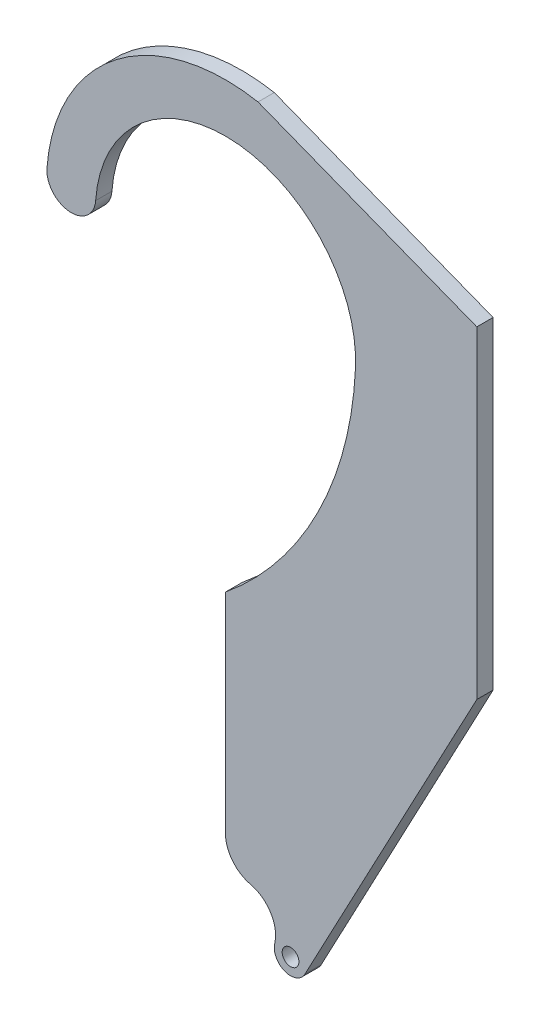
ISO-10303-21;
HEADER;
FILE_DESCRIPTION(('STEP AP214'),'2;1');
FILE_NAME('part.step','',(''),(''),'','','');
FILE_SCHEMA(('AUTOMOTIVE_DESIGN { 1 0 10303 214 1 1 1 1 }'));
ENDSEC;
DATA;
#1=APPLICATION_CONTEXT('core data for automotive mechanical design processes');
#2=APPLICATION_PROTOCOL_DEFINITION('international standard','automotive_design',2000,#1);
#3=PRODUCT_CONTEXT('',#1,'mechanical');
#4=PRODUCT('Part','Part','',(#3));
#5=PRODUCT_RELATED_PRODUCT_CATEGORY('part','',(#4));
#6=PRODUCT_DEFINITION_FORMATION('','',#4);
#7=PRODUCT_DEFINITION_CONTEXT('part definition',#1,'design');
#8=PRODUCT_DEFINITION('design','',#6,#7);
#9=PRODUCT_DEFINITION_SHAPE('','',#8);
#10=(LENGTH_UNIT() NAMED_UNIT(*) SI_UNIT(.MILLI.,.METRE.));
#11=(NAMED_UNIT(*) PLANE_ANGLE_UNIT() SI_UNIT($,.RADIAN.));
#12=(NAMED_UNIT(*) SI_UNIT($,.STERADIAN.) SOLID_ANGLE_UNIT());
#13=UNCERTAINTY_MEASURE_WITH_UNIT(LENGTH_MEASURE(1.E-05),#10,'distance_accuracy_value','');
#14=(GEOMETRIC_REPRESENTATION_CONTEXT(3) GLOBAL_UNCERTAINTY_ASSIGNED_CONTEXT((#13)) GLOBAL_UNIT_ASSIGNED_CONTEXT((#10,
#11,#12)) REPRESENTATION_CONTEXT('',''));
#15=CARTESIAN_POINT('',(0.,0.,0.));
#16=DIRECTION('',(0.,0.,1.));
#17=DIRECTION('',(1.,0.,0.));
#18=AXIS2_PLACEMENT_3D('',#15,#16,#17);
#19=CARTESIAN_POINT('',(-43.9714520688161,2.04932811099202,1.5875));
#20=DIRECTION('',(0.,0.,-1.));
#21=DIRECTION('',(-1.,0.,0.));
#22=AXIS2_PLACEMENT_3D('',#19,#20,#21);
#23=CYLINDRICAL_SURFACE('',#22,69.4191815319946);
#24=CARTESIAN_POINT('',(-43.9714520688161,2.04932811099202,-1.5875));
#25=DIRECTION('',(0.,0.,1.));
#26=DIRECTION('',(1.,0.,0.));
#27=AXIS2_PLACEMENT_3D('',#24,#25,#26);
#28=CIRCLE('',#27,69.4191815319946);
#29=CARTESIAN_POINT('',(0.,-51.667840164447,-1.5875));
#30=VERTEX_POINT('',#29);
#31=CARTESIAN_POINT('',(25.3724590889121,-1.18250572154241,-1.5875));
#32=VERTEX_POINT('',#31);
#33=EDGE_CURVE('E147',#30,#32,#28,.T.);
#34=ORIENTED_EDGE('',*,*,#33,.F.);
#35=DIRECTION('',(0.,0.,-1.));
#36=VECTOR('',#35,1.);
#37=CARTESIAN_POINT('',(0.,-51.667840164447,1.5875));
#38=LINE('',#37,#36);
#39=CARTESIAN_POINT('',(0.,-51.667840164447,1.5875));
#40=VERTEX_POINT('',#39);
#41=EDGE_CURVE('E11',#40,#30,#38,.T.);
#42=ORIENTED_EDGE('',*,*,#41,.F.);
#43=CARTESIAN_POINT('',(-43.9714520688161,2.04932811099202,1.5875));
#44=DIRECTION('',(0.,0.,1.));
#45=DIRECTION('',(1.,0.,0.));
#46=AXIS2_PLACEMENT_3D('',#43,#44,#45);
#47=CIRCLE('',#46,69.4191815319946);
#48=CARTESIAN_POINT('',(25.3724590889121,-1.18250572154241,1.5875));
#49=VERTEX_POINT('',#48);
#50=EDGE_CURVE('E175',#40,#49,#47,.T.);
#51=ORIENTED_EDGE('',*,*,#50,.T.);
#52=DIRECTION('',(0.,0.,-1.));
#53=VECTOR('',#52,1.);
#54=CARTESIAN_POINT('',(25.3724590889121,-1.18250572154241,1.5875));
#55=LINE('',#54,#53);
#56=EDGE_CURVE('E51',#49,#32,#55,.T.);
#57=ORIENTED_EDGE('',*,*,#56,.T.);
#58=EDGE_LOOP('',(#34,#42,#51,#57));
#59=FACE_BOUND('',#58,.T.);
#60=ADVANCED_FACE('F35',(#59),#23,.F.);
#61=CARTESIAN_POINT('',(0.,0.,1.5875));
#62=DIRECTION('',(-1.,0.,0.));
#63=DIRECTION('',(0.,0.,1.));
#64=AXIS2_PLACEMENT_3D('',#61,#62,#63);
#65=PLANE('',#64);
#66=DIRECTION('',(0.,1.,0.));
#67=VECTOR('',#66,1.);
#68=CARTESIAN_POINT('',(0.,0.,-1.5875));
#69=LINE('',#68,#67);
#70=CARTESIAN_POINT('',(0.,-92.4442334166062,-1.5875));
#71=VERTEX_POINT('',#70);
#72=EDGE_CURVE('E149',#71,#30,#69,.T.);
#73=ORIENTED_EDGE('',*,*,#72,.F.);
#74=DIRECTION('',(0.,0.,-1.));
#75=VECTOR('',#74,1.);
#76=CARTESIAN_POINT('',(0.,-92.4442334166062,1.5875));
#77=LINE('',#76,#75);
#78=CARTESIAN_POINT('',(0.,-92.4442334166062,1.5875));
#79=VERTEX_POINT('',#78);
#80=EDGE_CURVE('E43',#79,#71,#77,.T.);
#81=ORIENTED_EDGE('',*,*,#80,.F.);
#82=DIRECTION('',(0.,1.,0.));
#83=VECTOR('',#82,1.);
#84=CARTESIAN_POINT('',(0.,0.,1.5875));
#85=LINE('',#84,#83);
#86=EDGE_CURVE('E204',#79,#40,#85,.T.);
#87=ORIENTED_EDGE('',*,*,#86,.T.);
#88=ORIENTED_EDGE('',*,*,#41,.T.);
#89=EDGE_LOOP('',(#73,#81,#87,#88));
#90=FACE_BOUND('',#89,.T.);
#91=ADVANCED_FACE('F203',(#90),#65,.T.);
#92=CARTESIAN_POINT('',(6.35,-92.4442334166062,1.5875));
#93=DIRECTION('',(0.,0.,-1.));
#94=DIRECTION('',(-1.,0.,0.));
#95=AXIS2_PLACEMENT_3D('',#92,#93,#94);
#96=CYLINDRICAL_SURFACE('',#95,6.35);
#97=CARTESIAN_POINT('',(6.35,-92.4442334166062,-1.5875));
#98=DIRECTION('',(0.,0.,1.));
#99=DIRECTION('',(1.,0.,0.));
#100=AXIS2_PLACEMENT_3D('',#97,#98,#99);
#101=CIRCLE('',#100,6.35);
#102=CARTESIAN_POINT('',(4.89007732044275,-98.6241303226812,-1.5875));
#103=VERTEX_POINT('',#102);
#104=EDGE_CURVE('E153',#71,#103,#101,.T.);
#105=ORIENTED_EDGE('',*,*,#104,.T.);
#106=DIRECTION('',(0.,0.,-1.));
#107=VECTOR('',#106,1.);
#108=CARTESIAN_POINT('',(4.89007732044275,-98.6241303226812,1.5875));
#109=LINE('',#108,#107);
#110=CARTESIAN_POINT('',(4.89007732044275,-98.6241303226812,1.5875));
#111=VERTEX_POINT('',#110);
#112=EDGE_CURVE('E188',#111,#103,#109,.T.);
#113=ORIENTED_EDGE('',*,*,#112,.F.);
#114=CARTESIAN_POINT('',(6.35,-92.4442334166062,1.5875));
#115=DIRECTION('',(0.,0.,1.));
#116=DIRECTION('',(1.,0.,0.));
#117=AXIS2_PLACEMENT_3D('',#114,#115,#116);
#118=CIRCLE('',#117,6.35);
#119=EDGE_CURVE('E194',#79,#111,#118,.T.);
#120=ORIENTED_EDGE('',*,*,#119,.F.);
#121=ORIENTED_EDGE('',*,*,#80,.T.);
#122=EDGE_LOOP('',(#105,#113,#120,#121));
#123=FACE_BOUND('',#122,.T.);
#124=ADVANCED_FACE('F192',(#123),#96,.T.);
#125=CARTESIAN_POINT('',(3.43015464088551,-104.804027228756,1.5875));
#126=DIRECTION('',(0.,0.,-1.));
#127=DIRECTION('',(-1.,0.,0.));
#128=AXIS2_PLACEMENT_3D('',#125,#126,#127);
#129=CYLINDRICAL_SURFACE('',#128,6.35);
#130=CARTESIAN_POINT('',(3.43015464088551,-104.804027228756,-1.5875));
#131=DIRECTION('',(0.,0.,1.));
#132=DIRECTION('',(1.,0.,0.));
#133=AXIS2_PLACEMENT_3D('',#130,#131,#132);
#134=CIRCLE('',#133,6.35);
#135=CARTESIAN_POINT('',(9.61005154695762,-106.263949908313,-1.5875));
#136=VERTEX_POINT('',#135);
#137=EDGE_CURVE('E156',#136,#103,#134,.T.);
#138=ORIENTED_EDGE('',*,*,#137,.F.);
#139=DIRECTION('',(0.,0.,-1.));
#140=VECTOR('',#139,1.);
#141=CARTESIAN_POINT('',(9.61005154695762,-106.263949908313,1.5875));
#142=LINE('',#141,#140);
#143=CARTESIAN_POINT('',(9.61005154695762,-106.263949908313,1.5875));
#144=VERTEX_POINT('',#143);
#145=EDGE_CURVE('E186',#144,#136,#142,.T.);
#146=ORIENTED_EDGE('',*,*,#145,.F.);
#147=CARTESIAN_POINT('',(3.43015464088551,-104.804027228756,1.5875));
#148=DIRECTION('',(0.,0.,1.));
#149=DIRECTION('',(1.,0.,0.));
#150=AXIS2_PLACEMENT_3D('',#147,#148,#149);
#151=CIRCLE('',#150,6.35);
#152=EDGE_CURVE('E302',#144,#111,#151,.T.);
#153=ORIENTED_EDGE('',*,*,#152,.T.);
#154=ORIENTED_EDGE('',*,*,#112,.T.);
#155=EDGE_LOOP('',(#138,#146,#153,#154));
#156=FACE_BOUND('',#155,.T.);
#157=ADVANCED_FACE('F223',(#156),#129,.F.);
#158=CARTESIAN_POINT('',(12.6999999999979,-106.993911248092,1.5875));
#159=DIRECTION('',(0.,0.,-1.));
#160=DIRECTION('',(-1.,0.,0.));
#161=AXIS2_PLACEMENT_3D('',#158,#159,#160);
#162=CYLINDRICAL_SURFACE('',#161,3.17500000000289);
#163=CARTESIAN_POINT('',(12.6999999999979,-106.993911248092,-1.5875));
#164=DIRECTION('',(0.,0.,1.));
#165=DIRECTION('',(1.,0.,0.));
#166=AXIS2_PLACEMENT_3D('',#163,#164,#165);
#167=CIRCLE('',#166,3.17500000000289);
#168=CARTESIAN_POINT('',(15.5042733421712,-108.482761818964,-1.5875));
#169=VERTEX_POINT('',#168);
#170=EDGE_CURVE('E159',#136,#169,#167,.T.);
#171=ORIENTED_EDGE('',*,*,#170,.T.);
#172=DIRECTION('',(0.,0.,-1.));
#173=VECTOR('',#172,1.);
#174=CARTESIAN_POINT('',(15.5042733421712,-108.482761818964,1.5875));
#175=LINE('',#174,#173);
#176=CARTESIAN_POINT('',(15.5042733421712,-108.482761818964,1.5875));
#177=VERTEX_POINT('',#176);
#178=EDGE_CURVE('E183',#177,#169,#175,.T.);
#179=ORIENTED_EDGE('',*,*,#178,.F.);
#180=CARTESIAN_POINT('',(12.6999999999979,-106.993911248092,1.5875));
#181=DIRECTION('',(0.,0.,1.));
#182=DIRECTION('',(1.,0.,0.));
#183=AXIS2_PLACEMENT_3D('',#180,#181,#182);
#184=CIRCLE('',#183,3.17500000000289);
#185=EDGE_CURVE('E305',#144,#177,#184,.T.);
#186=ORIENTED_EDGE('',*,*,#185,.F.);
#187=ORIENTED_EDGE('',*,*,#145,.T.);
#188=EDGE_LOOP('',(#171,#179,#186,#187));
#189=FACE_BOUND('',#188,.T.);
#190=ADVANCED_FACE('F228',(#189),#162,.T.);
#191=CARTESIAN_POINT('',(57.0258255774436,-30.2762686106827,1.5875));
#192=DIRECTION('',(-0.883235698321893,0.468929313660211,0.));
#193=DIRECTION('',(-0.468929313660212,-0.883235698321894,0.));
#194=AXIS2_PLACEMENT_3D('',#191,#192,#193);
#195=PLANE('',#194);
#196=DIRECTION('',(0.468929313660212,0.883235698321894,0.));
#197=VECTOR('',#196,1.);
#198=CARTESIAN_POINT('',(57.0258255774436,-30.2762686106827,-1.5875));
#199=LINE('',#198,#197);
#200=CARTESIAN_POINT('',(49.0487017814658,-45.3013060764487,-1.5875));
#201=VERTEX_POINT('',#200);
#202=EDGE_CURVE('E161',#169,#201,#199,.T.);
#203=ORIENTED_EDGE('',*,*,#202,.T.);
#204=DIRECTION('',(0.,0.,-1.));
#205=VECTOR('',#204,1.);
#206=CARTESIAN_POINT('',(49.0487017814658,-45.3013060764487,1.5875));
#207=LINE('',#206,#205);
#208=CARTESIAN_POINT('',(49.0487017814658,-45.3013060764487,1.5875));
#209=VERTEX_POINT('',#208);
#210=EDGE_CURVE('E181',#209,#201,#207,.T.);
#211=ORIENTED_EDGE('',*,*,#210,.F.);
#212=DIRECTION('',(0.468929313660212,0.883235698321894,0.));
#213=VECTOR('',#212,1.);
#214=CARTESIAN_POINT('',(57.0258255774436,-30.2762686106827,1.5875));
#215=LINE('',#214,#213);
#216=EDGE_CURVE('E307',#177,#209,#215,.T.);
#217=ORIENTED_EDGE('',*,*,#216,.F.);
#218=ORIENTED_EDGE('',*,*,#178,.T.);
#219=EDGE_LOOP('',(#203,#211,#217,#218));
#220=FACE_BOUND('',#219,.T.);
#221=ADVANCED_FACE('F232',(#220),#195,.F.);
#222=CARTESIAN_POINT('',(49.0487017814658,0.,1.5875));
#223=DIRECTION('',(1.,0.,0.));
#224=DIRECTION('',(0.,0.,-1.));
#225=AXIS2_PLACEMENT_3D('',#222,#223,#224);
#226=PLANE('',#225);
#227=DIRECTION('',(0.,-1.,0.));
#228=VECTOR('',#227,1.);
#229=CARTESIAN_POINT('',(49.0487017814658,0.,-1.5875));
#230=LINE('',#229,#228);
#231=CARTESIAN_POINT('',(49.0487017814658,17.6816272117506,-1.5875));
#232=VERTEX_POINT('',#231);
#233=EDGE_CURVE('E164',#232,#201,#230,.T.);
#234=ORIENTED_EDGE('',*,*,#233,.F.);
#235=DIRECTION('',(0.,0.,-1.));
#236=VECTOR('',#235,1.);
#237=CARTESIAN_POINT('',(49.0487017814658,17.6816272117506,1.5875));
#238=LINE('',#237,#236);
#239=CARTESIAN_POINT('',(49.0487017814658,17.6816272117506,1.5875));
#240=VERTEX_POINT('',#239);
#241=EDGE_CURVE('E179',#240,#232,#238,.T.);
#242=ORIENTED_EDGE('',*,*,#241,.F.);
#243=DIRECTION('',(0.,-1.,0.));
#244=VECTOR('',#243,1.);
#245=CARTESIAN_POINT('',(49.0487017814658,0.,1.5875));
#246=LINE('',#245,#244);
#247=EDGE_CURVE('E309',#240,#209,#246,.T.);
#248=ORIENTED_EDGE('',*,*,#247,.T.);
#249=ORIENTED_EDGE('',*,*,#210,.T.);
#250=EDGE_LOOP('',(#234,#242,#248,#249));
#251=FACE_BOUND('',#250,.T.);
#252=ADVANCED_FACE('F236',(#251),#226,.T.);
#253=CARTESIAN_POINT('',(12.4695560824181,31.9554343891598,1.5875));
#254=DIRECTION('',(-0.363520795117148,-0.931586083793332,0.));
#255=DIRECTION('',(0.931586083793332,-0.363520795117148,0.));
#256=AXIS2_PLACEMENT_3D('',#253,#254,#255);
#257=PLANE('',#256);
#258=DIRECTION('',(-0.931586083793332,0.363520795117148,0.));
#259=VECTOR('',#258,1.);
#260=CARTESIAN_POINT('',(12.4695560824181,31.9554343891598,-1.5875));
#261=LINE('',#260,#259);
#262=CARTESIAN_POINT('',(6.35250270971501,34.3424130532941,-1.5875));
#263=VERTEX_POINT('',#262);
#264=EDGE_CURVE('E167',#232,#263,#261,.T.);
#265=ORIENTED_EDGE('',*,*,#264,.T.);
#266=DIRECTION('',(0.,0.,-1.));
#267=VECTOR('',#266,1.);
#268=CARTESIAN_POINT('',(6.35250270971501,34.3424130532941,1.5875));
#269=LINE('',#268,#267);
#270=CARTESIAN_POINT('',(6.35250270971501,34.3424130532941,1.5875));
#271=VERTEX_POINT('',#270);
#272=EDGE_CURVE('E139',#271,#263,#269,.T.);
#273=ORIENTED_EDGE('',*,*,#272,.F.);
#274=DIRECTION('',(-0.931586083793332,0.363520795117148,0.));
#275=VECTOR('',#274,1.);
#276=CARTESIAN_POINT('',(12.4695560824181,31.9554343891598,1.5875));
#277=LINE('',#276,#275);
#278=EDGE_CURVE('E127',#240,#271,#277,.T.);
#279=ORIENTED_EDGE('',*,*,#278,.F.);
#280=ORIENTED_EDGE('',*,*,#241,.T.);
#281=EDGE_LOOP('',(#265,#273,#279,#280));
#282=FACE_BOUND('',#281,.T.);
#283=ADVANCED_FACE('F240',(#282),#257,.F.);
#284=CARTESIAN_POINT('',(0.,0.,1.5875));
#285=DIRECTION('',(0.,0.,-1.));
#286=DIRECTION('',(-1.,0.,0.));
#287=AXIS2_PLACEMENT_3D('',#284,#285,#286);
#288=CYLINDRICAL_SURFACE('',#287,34.925);
#289=CARTESIAN_POINT('',(0.,0.,-1.5875));
#290=DIRECTION('',(0.,0.,1.));
#291=DIRECTION('',(1.,0.,0.));
#292=AXIS2_PLACEMENT_3D('',#289,#290,#291);
#293=CIRCLE('',#292,34.925);
#294=CARTESIAN_POINT('',(-34.8350675440203,2.50473435787914,-1.5875));
#295=VERTEX_POINT('',#294);
#296=EDGE_CURVE('E136',#263,#295,#293,.T.);
#297=ORIENTED_EDGE('',*,*,#296,.T.);
#298=DIRECTION('',(0.,0.,-1.));
#299=VECTOR('',#298,1.);
#300=CARTESIAN_POINT('',(-34.8350675440203,2.50473435787914,1.5875));
#301=LINE('',#300,#299);
#302=CARTESIAN_POINT('',(-34.8350675440203,2.50473435787914,1.5875));
#303=VERTEX_POINT('',#302);
#304=EDGE_CURVE('E133',#303,#295,#301,.T.);
#305=ORIENTED_EDGE('',*,*,#304,.F.);
#306=CARTESIAN_POINT('',(0.,0.,1.5875));
#307=DIRECTION('',(0.,0.,1.));
#308=DIRECTION('',(1.,0.,0.));
#309=AXIS2_PLACEMENT_3D('',#306,#307,#308);
#310=CIRCLE('',#309,34.925);
#311=EDGE_CURVE('E119',#271,#303,#310,.T.);
#312=ORIENTED_EDGE('',*,*,#311,.F.);
#313=ORIENTED_EDGE('',*,*,#272,.T.);
#314=EDGE_LOOP('',(#297,#305,#312,#313));
#315=FACE_BOUND('',#314,.T.);
#316=ADVANCED_FACE('F134',(#315),#288,.T.);
#317=CARTESIAN_POINT('',(-30.0848310607448,2.1631796727138,1.5875));
#318=DIRECTION('',(0.,0.,-1.));
#319=DIRECTION('',(-1.,0.,0.));
#320=AXIS2_PLACEMENT_3D('',#317,#318,#319);
#321=CYLINDRICAL_SURFACE('',#320,4.7625);
#322=CARTESIAN_POINT('',(-30.0848310607448,2.1631796727138,-1.5875));
#323=DIRECTION('',(0.,0.,1.));
#324=DIRECTION('',(1.,0.,0.));
#325=AXIS2_PLACEMENT_3D('',#322,#323,#324);
#326=CIRCLE('',#325,4.7625);
#327=CARTESIAN_POINT('',(-25.3345945774693,1.82162498754846,-1.5875));
#328=VERTEX_POINT('',#327);
#329=EDGE_CURVE('E170',#295,#328,#326,.T.);
#330=ORIENTED_EDGE('',*,*,#329,.T.);
#331=DIRECTION('',(0.,0.,-1.));
#332=VECTOR('',#331,1.);
#333=CARTESIAN_POINT('',(-25.3345945774693,1.82162498754846,1.5875));
#334=LINE('',#333,#332);
#335=CARTESIAN_POINT('',(-25.3345945774693,1.82162498754846,1.5875));
#336=VERTEX_POINT('',#335);
#337=EDGE_CURVE('E86',#336,#328,#334,.T.);
#338=ORIENTED_EDGE('',*,*,#337,.F.);
#339=CARTESIAN_POINT('',(-30.0848310607448,2.1631796727138,1.5875));
#340=DIRECTION('',(0.,0.,1.));
#341=DIRECTION('',(1.,0.,0.));
#342=AXIS2_PLACEMENT_3D('',#339,#340,#341);
#343=CIRCLE('',#342,4.7625);
#344=EDGE_CURVE('E124',#303,#336,#343,.T.);
#345=ORIENTED_EDGE('',*,*,#344,.F.);
#346=ORIENTED_EDGE('',*,*,#304,.T.);
#347=EDGE_LOOP('',(#330,#338,#345,#346));
#348=FACE_BOUND('',#347,.T.);
#349=ADVANCED_FACE('F141',(#348),#321,.T.);
#350=CARTESIAN_POINT('',(0.,0.,1.5875));
#351=DIRECTION('',(0.,0.,-1.));
#352=DIRECTION('',(-1.,0.,0.));
#353=AXIS2_PLACEMENT_3D('',#350,#351,#352);
#354=CYLINDRICAL_SURFACE('',#353,25.4);
#355=CARTESIAN_POINT('',(0.,0.,-1.5875));
#356=DIRECTION('',(0.,0.,1.));
#357=DIRECTION('',(1.,0.,0.));
#358=AXIS2_PLACEMENT_3D('',#355,#356,#357);
#359=CIRCLE('',#358,25.4);
#360=EDGE_CURVE('E172',#32,#328,#359,.T.);
#361=ORIENTED_EDGE('',*,*,#360,.F.);
#362=ORIENTED_EDGE('',*,*,#56,.F.);
#363=CARTESIAN_POINT('',(0.,0.,1.5875));
#364=DIRECTION('',(0.,0.,1.));
#365=DIRECTION('',(1.,0.,0.));
#366=AXIS2_PLACEMENT_3D('',#363,#364,#365);
#367=CIRCLE('',#366,25.4);
#368=EDGE_CURVE('E142',#49,#336,#367,.T.);
#369=ORIENTED_EDGE('',*,*,#368,.T.);
#370=ORIENTED_EDGE('',*,*,#337,.T.);
#371=EDGE_LOOP('',(#361,#362,#369,#370));
#372=FACE_BOUND('',#371,.T.);
#373=ADVANCED_FACE('F205',(#372),#354,.F.);
#374=CARTESIAN_POINT('',(0.,0.,1.5875));
#375=DIRECTION('',(0.,0.,1.));
#376=DIRECTION('',(1.,0.,0.));
#377=AXIS2_PLACEMENT_3D('',#374,#375,#376);
#378=PLANE('',#377);
#379=CARTESIAN_POINT('',(12.6999999999819,-106.993911248077,1.5875));
#380=DIRECTION('',(0.,0.,1.));
#381=DIRECTION('',(1.,0.,0.));
#382=AXIS2_PLACEMENT_3D('',#379,#380,#381);
#383=CIRCLE('',#382,1.63194999999999);
#384=CARTESIAN_POINT('',(14.3319499999819,-106.993911248077,1.5875));
#385=VERTEX_POINT('',#384);
#386=EDGE_CURVE('E295',#385,#385,#383,.T.);
#387=ORIENTED_EDGE('',*,*,#386,.F.);
#388=EDGE_LOOP('',(#387));
#389=FACE_BOUND('',#388,.T.);
#390=ORIENTED_EDGE('',*,*,#50,.F.);
#391=ORIENTED_EDGE('',*,*,#86,.F.);
#392=ORIENTED_EDGE('',*,*,#119,.T.);
#393=ORIENTED_EDGE('',*,*,#152,.F.);
#394=ORIENTED_EDGE('',*,*,#185,.T.);
#395=ORIENTED_EDGE('',*,*,#216,.T.);
#396=ORIENTED_EDGE('',*,*,#247,.F.);
#397=ORIENTED_EDGE('',*,*,#278,.T.);
#398=ORIENTED_EDGE('',*,*,#311,.T.);
#399=ORIENTED_EDGE('',*,*,#344,.T.);
#400=ORIENTED_EDGE('',*,*,#368,.F.);
#401=EDGE_LOOP('',(#390,#391,#392,#393,#394,#395,#396,#397,#398,#399,#400));
#402=FACE_BOUND('',#401,.T.);
#403=ADVANCED_FACE('F121',(#389,#402),#378,.T.);
#404=CARTESIAN_POINT('',(0.,0.,-1.5875));
#405=DIRECTION('',(0.,0.,1.));
#406=DIRECTION('',(1.,0.,0.));
#407=AXIS2_PLACEMENT_3D('',#404,#405,#406);
#408=PLANE('',#407);
#409=CARTESIAN_POINT('',(12.6999999999819,-106.993911248077,-1.5875));
#410=DIRECTION('',(0.,0.,1.));
#411=DIRECTION('',(1.,0.,0.));
#412=AXIS2_PLACEMENT_3D('',#409,#410,#411);
#413=CIRCLE('',#412,1.63195);
#414=CARTESIAN_POINT('',(14.3319499999819,-106.993911248077,-1.5875));
#415=VERTEX_POINT('',#414);
#416=EDGE_CURVE('E150',#415,#415,#413,.T.);
#417=ORIENTED_EDGE('',*,*,#416,.T.);
#418=EDGE_LOOP('',(#417));
#419=FACE_BOUND('',#418,.T.);
#420=ORIENTED_EDGE('',*,*,#33,.T.);
#421=ORIENTED_EDGE('',*,*,#360,.T.);
#422=ORIENTED_EDGE('',*,*,#329,.F.);
#423=ORIENTED_EDGE('',*,*,#296,.F.);
#424=ORIENTED_EDGE('',*,*,#264,.F.);
#425=ORIENTED_EDGE('',*,*,#233,.T.);
#426=ORIENTED_EDGE('',*,*,#202,.F.);
#427=ORIENTED_EDGE('',*,*,#170,.F.);
#428=ORIENTED_EDGE('',*,*,#137,.T.);
#429=ORIENTED_EDGE('',*,*,#104,.F.);
#430=ORIENTED_EDGE('',*,*,#72,.T.);
#431=EDGE_LOOP('',(#420,#421,#422,#423,#424,#425,#426,#427,#428,#429,#430));
#432=FACE_BOUND('',#431,.T.);
#433=ADVANCED_FACE('F200',(#419,#432),#408,.F.);
#434=CARTESIAN_POINT('',(12.6999999999819,-106.993911248077,1.5875));
#435=DIRECTION('',(0.,0.,1.));
#436=DIRECTION('',(1.,0.,0.));
#437=AXIS2_PLACEMENT_3D('',#434,#435,#436);
#438=CYLINDRICAL_SURFACE('',#437,1.63194999999999);
#439=ORIENTED_EDGE('',*,*,#416,.F.);
#440=EDGE_LOOP('',(#439));
#441=FACE_BOUND('',#440,.T.);
#442=ORIENTED_EDGE('',*,*,#386,.T.);
#443=EDGE_LOOP('',(#442));
#444=FACE_BOUND('',#443,.T.);
#445=ADVANCED_FACE('F276',(#441,#444),#438,.F.);
#446=CLOSED_SHELL('',(#60,#91,#124,#157,#190,#221,#252,#283,#316,#349,#373,#403,#433,#445));
#447=MANIFOLD_SOLID_BREP('B2',#446);
#448=ADVANCED_BREP_SHAPE_REPRESENTATION('',(#18,#447),#14);
#449=SHAPE_DEFINITION_REPRESENTATION(#9,#448);
ENDSEC;
END-ISO-10303-21;
